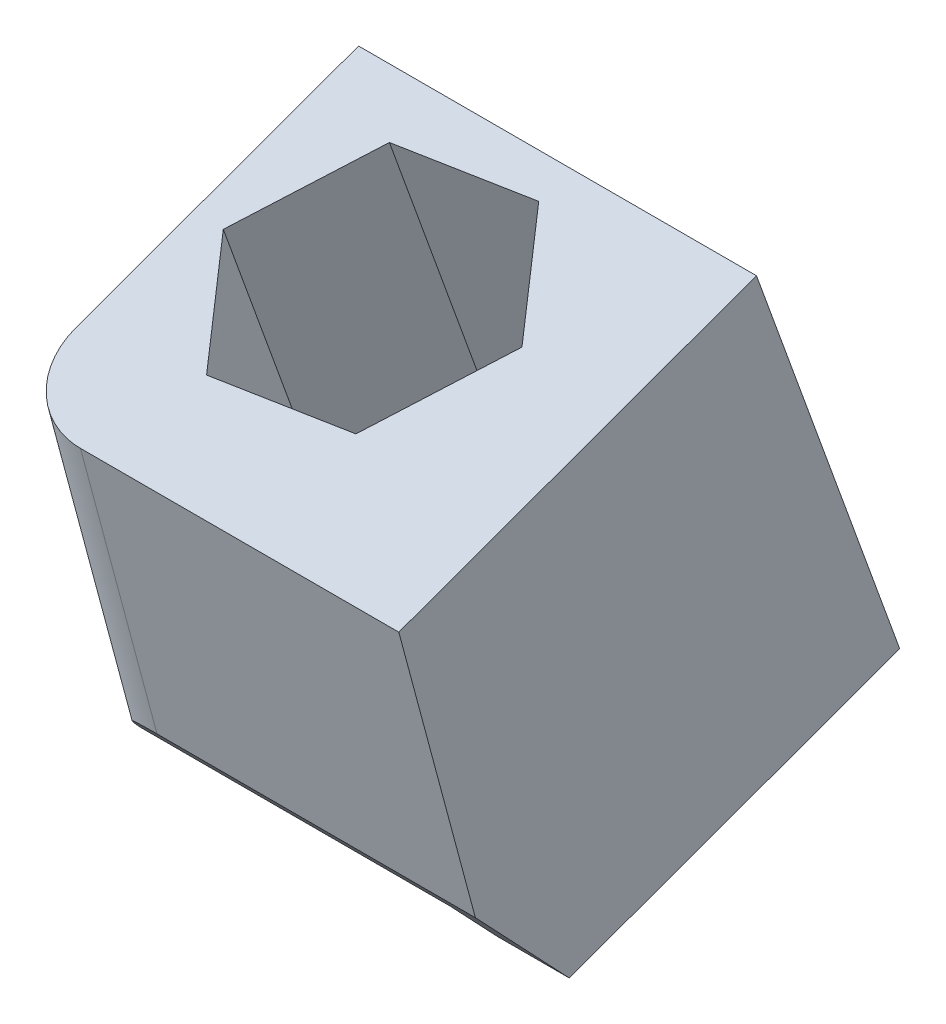
ISO-10303-21;
HEADER;
FILE_DESCRIPTION(('STEP AP214'),'2;1');
FILE_NAME('part.step','',(''),(''),'','','');
FILE_SCHEMA(('AUTOMOTIVE_DESIGN { 1 0 10303 214 1 1 1 1 }'));
ENDSEC;
DATA;
#1=APPLICATION_CONTEXT('core data for automotive mechanical design processes');
#2=APPLICATION_PROTOCOL_DEFINITION('international standard','automotive_design',2000,#1);
#3=PRODUCT_CONTEXT('',#1,'mechanical');
#4=PRODUCT('Part','Part','',(#3));
#5=PRODUCT_RELATED_PRODUCT_CATEGORY('part','',(#4));
#6=PRODUCT_DEFINITION_FORMATION('','',#4);
#7=PRODUCT_DEFINITION_CONTEXT('part definition',#1,'design');
#8=PRODUCT_DEFINITION('design','',#6,#7);
#9=PRODUCT_DEFINITION_SHAPE('','',#8);
#10=(LENGTH_UNIT() NAMED_UNIT(*) SI_UNIT(.MILLI.,.METRE.));
#11=(NAMED_UNIT(*) PLANE_ANGLE_UNIT() SI_UNIT($,.RADIAN.));
#12=(NAMED_UNIT(*) SI_UNIT($,.STERADIAN.) SOLID_ANGLE_UNIT());
#13=UNCERTAINTY_MEASURE_WITH_UNIT(LENGTH_MEASURE(1.E-05),#10,'distance_accuracy_value','');
#14=(GEOMETRIC_REPRESENTATION_CONTEXT(3) GLOBAL_UNCERTAINTY_ASSIGNED_CONTEXT((#13)) GLOBAL_UNIT_ASSIGNED_CONTEXT((#10,
#11,#12)) REPRESENTATION_CONTEXT('',''));
#15=CARTESIAN_POINT('',(0.,0.,0.));
#16=DIRECTION('',(0.,0.,1.));
#17=DIRECTION('',(1.,0.,0.));
#18=AXIS2_PLACEMENT_3D('',#15,#16,#17);
#19=CARTESIAN_POINT('',(0.,0.,0.));
#20=DIRECTION('',(-1.,0.,0.));
#21=DIRECTION('',(0.,0.,-1.));
#22=AXIS2_PLACEMENT_3D('',#19,#20,#21);
#23=PLANE('',#22);
#24=DIRECTION('',(0.,0.341123131095332,-0.940018621853693));
#25=VECTOR('',#24,1.);
#26=CARTESIAN_POINT('',(0.,171.265590649727,97.4199582610171));
#27=LINE('',#26,#25);
#28=CARTESIAN_POINT('',(0.,168.688536046259,104.521438917035));
#29=VERTEX_POINT('',#28);
#30=CARTESIAN_POINT('',(0.,171.265590649727,97.4199582610171));
#31=VERTEX_POINT('',#30);
#32=EDGE_CURVE('E209',#29,#31,#27,.T.);
#33=ORIENTED_EDGE('',*,*,#32,.T.);
#34=DIRECTION('',(0.,-0.940018621853693,-0.341123131095332));
#35=VECTOR('',#34,1.);
#36=CARTESIAN_POINT('',(0.,171.265590649727,97.4199582610171));
#37=LINE('',#36,#35);
#38=CARTESIAN_POINT('',(0.,162.852423984136,94.3669062377139));
#39=VERTEX_POINT('',#38);
#40=EDGE_CURVE('E214',#31,#39,#37,.T.);
#41=ORIENTED_EDGE('',*,*,#40,.T.);
#42=DIRECTION('',(0.,-0.341123131095332,0.940018621853693));
#43=VECTOR('',#42,1.);
#44=CARTESIAN_POINT('',(0.,162.852423984136,94.3669062377139));
#45=LINE('',#44,#43);
#46=CARTESIAN_POINT('',(0.,160.011650268805,102.195106525128));
#47=VERTEX_POINT('',#46);
#48=EDGE_CURVE('E144',#39,#47,#45,.T.);
#49=ORIENTED_EDGE('',*,*,#48,.T.);
#50=DIRECTION('',(0.,0.965887749349842,0.258961108384823));
#51=VECTOR('',#50,1.);
#52=CARTESIAN_POINT('',(0.,161.344698217693,102.552505792907));
#53=LINE('',#52,#51);
#54=EDGE_CURVE('E246',#29,#47,#53,.F.);
#55=ORIENTED_EDGE('',*,*,#54,.F.);
#56=EDGE_LOOP('',(#33,#41,#49,#55));
#57=FACE_BOUND('',#56,.T.);
#58=ADVANCED_FACE('F35',(#57),#23,.T.);
#59=CARTESIAN_POINT('',(5.34740721586496,172.331144249481,98.7343217056999));
#60=DIRECTION('',(-0.138711114408334,0.33782545518257,-0.930931355455539));
#61=DIRECTION('',(0.,-0.940018621853693,-0.341123131095333));
#62=AXIS2_PLACEMENT_3D('',#59,#60,#61);
#63=PLANE('',#62);
#64=DIRECTION('',(0.990332886831291,0.0473175696646939,-0.130391030601912));
#65=VECTOR('',#64,1.);
#66=CARTESIAN_POINT('',(5.34740721586496,162.554950582203,95.1866411423085));
#67=LINE('',#66,#65);
#68=CARTESIAN_POINT('',(2.03114725482848,162.39650147502,95.6232726626925));
#69=VERTEX_POINT('',#68);
#70=CARTESIAN_POINT('',(5.34740721586496,162.554950582203,95.1866411423085));
#71=VERTEX_POINT('',#70);
#72=EDGE_CURVE('E173',#69,#71,#67,.T.);
#73=ORIENTED_EDGE('',*,*,#72,.T.);
#74=DIRECTION('',(0.,-0.940018621853693,-0.341123131095333));
#75=VECTOR('',#74,1.);
#76=CARTESIAN_POINT('',(5.34740721586496,172.331144249481,98.7343217056999));
#77=LINE('',#76,#75);
#78=CARTESIAN_POINT('',(5.34740721586496,170.968117247793,98.2396931656117));
#79=VERTEX_POINT('',#78);
#80=EDGE_CURVE('E179',#79,#71,#77,.T.);
#81=ORIENTED_EDGE('',*,*,#80,.F.);
#82=DIRECTION('',(-0.990332886831291,-0.0473175696646938,0.130391030601912));
#83=VECTOR('',#82,1.);
#84=CARTESIAN_POINT('',(10.0302729632323,171.191862040254,97.6231290798492));
#85=LINE('',#84,#83);
#86=CARTESIAN_POINT('',(2.03114725482848,170.80966814061,98.6763246859957));
#87=VERTEX_POINT('',#86);
#88=EDGE_CURVE('E206',#79,#87,#85,.T.);
#89=ORIENTED_EDGE('',*,*,#88,.T.);
#90=DIRECTION('',(0.,-0.940018621853693,-0.341123131095333));
#91=VECTOR('',#90,1.);
#92=CARTESIAN_POINT('',(2.03114725482848,172.172695142298,99.1709532260839));
#93=LINE('',#92,#91);
#94=EDGE_CURVE('E178',#87,#69,#93,.T.);
#95=ORIENTED_EDGE('',*,*,#94,.T.);
#96=EDGE_LOOP('',(#73,#81,#89,#95));
#97=FACE_BOUND('',#96,.T.);
#98=ADVANCED_FACE('F276',(#97),#63,.F.);
#99=CARTESIAN_POINT('',(7.40779942816731,171.430674983043,101.215706876329));
#100=DIRECTION('',(0.788297880994922,0.209890944966245,-0.578387622654646));
#101=DIRECTION('',(0.591564845887052,0.,0.806257423600322));
#102=AXIS2_PLACEMENT_3D('',#99,#100,#101);
#103=PLANE('',#102);
#104=DIRECTION('',(0.615293792280498,-0.268906641400803,0.741014687703033));
#105=VECTOR('',#104,1.);
#106=CARTESIAN_POINT('',(7.40779942816732,161.654481315765,97.6680263129376));
#107=LINE('',#106,#105);
#108=CARTESIAN_POINT('',(7.40779942816731,161.654481315765,97.6680263129376));
#109=VERTEX_POINT('',#108);
#110=EDGE_CURVE('E170',#71,#109,#107,.T.);
#111=ORIENTED_EDGE('',*,*,#110,.T.);
#112=DIRECTION('',(0.,-0.940018621853693,-0.341123131095333));
#113=VECTOR('',#112,1.);
#114=CARTESIAN_POINT('',(7.40779942816731,171.430674983043,101.215706876329));
#115=LINE('',#114,#113);
#116=CARTESIAN_POINT('',(7.40779942816731,170.067647981355,100.721078336241));
#117=VERTEX_POINT('',#116);
#118=EDGE_CURVE('E183',#117,#109,#115,.T.);
#119=ORIENTED_EDGE('',*,*,#118,.F.);
#120=DIRECTION('',(-0.615293792280498,0.268906641400803,-0.741014687703033));
#121=VECTOR('',#120,1.);
#122=CARTESIAN_POINT('',(6.68584551470969,170.383169126782,99.8516100262584));
#123=LINE('',#122,#121);
#124=EDGE_CURVE('E204',#117,#79,#123,.T.);
#125=ORIENTED_EDGE('',*,*,#124,.T.);
#126=ORIENTED_EDGE('',*,*,#80,.T.);
#127=EDGE_LOOP('',(#111,#119,#125,#126));
#128=FACE_BOUND('',#127,.T.);
#129=ADVANCED_FACE('F280',(#128),#103,.F.);
#130=CARTESIAN_POINT('',(6.15193167943325,170.371756609422,104.133723567342));
#131=DIRECTION('',(0.927008995403243,-0.127934510216321,0.352543732800881));
#132=DIRECTION('',(-0.355464722259819,0.,0.934689697829579));
#133=AXIS2_PLACEMENT_3D('',#130,#131,#132);
#134=PLANE('',#133);
#135=DIRECTION('',(-0.37503909455078,-0.316224211065493,0.871405718304934));
#136=VECTOR('',#135,1.);
#137=CARTESIAN_POINT('',(6.15193167943325,160.595562942144,100.586043003951));
#138=LINE('',#137,#136);
#139=CARTESIAN_POINT('',(6.15193167943325,160.595562942144,100.586043003951));
#140=VERTEX_POINT('',#139);
#141=EDGE_CURVE('E167',#109,#140,#138,.T.);
#142=ORIENTED_EDGE('',*,*,#141,.T.);
#143=DIRECTION('',(0.,-0.940018621853693,-0.341123131095333));
#144=VECTOR('',#143,1.);
#145=CARTESIAN_POINT('',(6.15193167943325,170.371756609422,104.133723567342));
#146=LINE('',#145,#144);
#147=CARTESIAN_POINT('',(6.15193167943325,169.008729607734,103.639095027254));
#148=VERTEX_POINT('',#147);
#149=EDGE_CURVE('E186',#148,#140,#146,.T.);
#150=ORIENTED_EDGE('',*,*,#149,.F.);
#151=DIRECTION('',(0.37503909455078,0.316224211065492,-0.871405718304934));
#152=VECTOR('',#151,1.);
#153=CARTESIAN_POINT('',(8.99331843252483,171.404520599616,97.037114858958));
#154=LINE('',#153,#152);
#155=EDGE_CURVE('E202',#148,#117,#154,.T.);
#156=ORIENTED_EDGE('',*,*,#155,.T.);
#157=ORIENTED_EDGE('',*,*,#118,.T.);
#158=EDGE_LOOP('',(#142,#150,#156,#157));
#159=FACE_BOUND('',#158,.T.);
#160=ADVANCED_FACE('F295',(#159),#134,.F.);
#161=CARTESIAN_POINT('',(2.83567171839683,170.213307502239,104.570355087726));
#162=DIRECTION('',(0.138711114408337,-0.33782545518257,0.930931355455539));
#163=DIRECTION('',(0.,0.940018621853693,0.341123131095333));
#164=AXIS2_PLACEMENT_3D('',#161,#162,#163);
#165=PLANE('',#164);
#166=DIRECTION('',(-0.99033288683129,-0.0473175696646948,0.130391030601915));
#167=VECTOR('',#166,1.);
#168=CARTESIAN_POINT('',(2.83567171839683,160.437113834961,101.022674524335));
#169=LINE('',#168,#167);
#170=CARTESIAN_POINT('',(2.83567171839683,160.437113834961,101.022674524335));
#171=VERTEX_POINT('',#170);
#172=EDGE_CURVE('E164',#140,#171,#169,.T.);
#173=ORIENTED_EDGE('',*,*,#172,.T.);
#174=DIRECTION('',(0.,-0.940018621853693,-0.341123131095333));
#175=VECTOR('',#174,1.);
#176=CARTESIAN_POINT('',(2.83567171839683,170.213307502239,104.570355087726));
#177=LINE('',#176,#175);
#178=CARTESIAN_POINT('',(2.83567171839683,168.850280500551,104.075726547638));
#179=VERTEX_POINT('',#178);
#180=EDGE_CURVE('E189',#179,#171,#177,.T.);
#181=ORIENTED_EDGE('',*,*,#180,.F.);
#182=DIRECTION('',(0.99033288683129,0.0473175696646947,-0.130391030601915));
#183=VECTOR('',#182,1.);
#184=CARTESIAN_POINT('',(10.8347974268006,169.232474400195,103.022530941491));
#185=LINE('',#184,#183);
#186=EDGE_CURVE('E200',#179,#148,#185,.T.);
#187=ORIENTED_EDGE('',*,*,#186,.T.);
#188=ORIENTED_EDGE('',*,*,#149,.T.);
#189=EDGE_LOOP('',(#173,#181,#187,#188));
#190=FACE_BOUND('',#189,.T.);
#191=ADVANCED_FACE('F291',(#190),#165,.F.);
#192=CARTESIAN_POINT('',(0.775279506094418,171.113776768677,102.088969917097));
#193=DIRECTION('',(-0.788297880994913,-0.209890944966249,0.578387622654656));
#194=DIRECTION('',(-0.591564845887063,0.,-0.806257423600314));
#195=AXIS2_PLACEMENT_3D('',#192,#193,#194);
#196=PLANE('',#195);
#197=DIRECTION('',(-0.615293792280509,0.2689066414008,-0.741014687703025));
#198=VECTOR('',#197,1.);
#199=CARTESIAN_POINT('',(0.775279506094421,161.337583101399,98.5412893537055));
#200=LINE('',#199,#198);
#201=CARTESIAN_POINT('',(0.775279506094418,161.337583101399,98.5412893537055));
#202=VERTEX_POINT('',#201);
#203=EDGE_CURVE('E152',#171,#202,#200,.T.);
#204=ORIENTED_EDGE('',*,*,#203,.T.);
#205=DIRECTION('',(0.,-0.940018621853693,-0.341123131095333));
#206=VECTOR('',#205,1.);
#207=CARTESIAN_POINT('',(0.775279506094418,171.113776768677,102.088969917097));
#208=LINE('',#207,#206);
#209=CARTESIAN_POINT('',(0.775279506094418,169.750749766989,101.594341377009));
#210=VERTEX_POINT('',#209);
#211=EDGE_CURVE('E192',#210,#202,#208,.T.);
#212=ORIENTED_EDGE('',*,*,#211,.F.);
#213=DIRECTION('',(0.615293792280509,-0.2689066414008,0.741014687703025));
#214=VECTOR('',#213,1.);
#215=CARTESIAN_POINT('',(2.1137178049392,169.165801645977,103.206258237656));
#216=LINE('',#215,#214);
#217=EDGE_CURVE('E198',#210,#179,#216,.T.);
#218=ORIENTED_EDGE('',*,*,#217,.T.);
#219=ORIENTED_EDGE('',*,*,#180,.T.);
#220=EDGE_LOOP('',(#204,#212,#218,#219));
#221=FACE_BOUND('',#220,.T.);
#222=ADVANCED_FACE('F287',(#221),#196,.F.);
#223=CARTESIAN_POINT('',(2.03114725482848,172.172695142298,99.1709532260839));
#224=DIRECTION('',(-0.927008995403244,0.127934510216321,-0.352543732800881));
#225=DIRECTION('',(0.355464722259818,0.,-0.934689697829579));
#226=AXIS2_PLACEMENT_3D('',#223,#224,#225);
#227=PLANE('',#226);
#228=DIRECTION('',(0.37503909455078,0.316224211065493,-0.871405718304934));
#229=VECTOR('',#228,1.);
#230=CARTESIAN_POINT('',(2.03114725482847,162.39650147502,95.6232726626925));
#231=LINE('',#230,#229);
#232=EDGE_CURVE('E239',#202,#69,#231,.T.);
#233=ORIENTED_EDGE('',*,*,#232,.T.);
#234=ORIENTED_EDGE('',*,*,#94,.F.);
#235=DIRECTION('',(-0.37503909455078,-0.316224211065493,0.871405718304934));
#236=VECTOR('',#235,1.);
#237=CARTESIAN_POINT('',(3.61666625918597,172.146540758871,94.9923612087129));
#238=LINE('',#237,#236);
#239=EDGE_CURVE('E182',#87,#210,#238,.T.);
#240=ORIENTED_EDGE('',*,*,#239,.T.);
#241=ORIENTED_EDGE('',*,*,#211,.T.);
#242=EDGE_LOOP('',(#233,#234,#240,#241));
#243=FACE_BOUND('',#242,.T.);
#244=ADVANCED_FACE('F284',(#243),#227,.F.);
#245=CARTESIAN_POINT('',(10.,171.265590649727,97.4199582610171));
#246=DIRECTION('',(0.,-0.940018621853693,-0.341123131095332));
#247=DIRECTION('',(0.,-0.341123131095332,0.940018621853693));
#248=AXIS2_PLACEMENT_3D('',#245,#246,#247);
#249=PLANE('',#248);
#250=ORIENTED_EDGE('',*,*,#124,.F.);
#251=ORIENTED_EDGE('',*,*,#155,.F.);
#252=ORIENTED_EDGE('',*,*,#186,.F.);
#253=ORIENTED_EDGE('',*,*,#217,.F.);
#254=ORIENTED_EDGE('',*,*,#239,.F.);
#255=ORIENTED_EDGE('',*,*,#88,.F.);
#256=EDGE_LOOP('',(#250,#251,#252,#253,#254,#255));
#257=FACE_BOUND('',#256,.T.);
#258=DIRECTION('',(-1.,0.,0.));
#259=VECTOR('',#258,1.);
#260=CARTESIAN_POINT('',(10.,168.00374929035,106.408476892109));
#261=LINE('',#260,#259);
#262=CARTESIAN_POINT('',(10.,168.00374929035,106.408476892109));
#263=VERTEX_POINT('',#262);
#264=CARTESIAN_POINT('',(2.,168.00374929035,106.408476892109));
#265=VERTEX_POINT('',#264);
#266=EDGE_CURVE('E224',#263,#265,#261,.T.);
#267=ORIENTED_EDGE('',*,*,#266,.F.);
#268=DIRECTION('',(0.,0.341123131095332,-0.940018621853693));
#269=VECTOR('',#268,1.);
#270=CARTESIAN_POINT('',(10.,171.265590649727,97.4199582610171));
#271=LINE('',#270,#269);
#272=CARTESIAN_POINT('',(10.,171.265590649727,97.4199582610171));
#273=VERTEX_POINT('',#272);
#274=EDGE_CURVE('E210',#263,#273,#271,.T.);
#275=ORIENTED_EDGE('',*,*,#274,.T.);
#276=DIRECTION('',(-1.,0.,0.));
#277=VECTOR('',#276,1.);
#278=CARTESIAN_POINT('',(10.,171.265590649727,97.4199582610171));
#279=LINE('',#278,#277);
#280=EDGE_CURVE('E237',#273,#31,#279,.T.);
#281=ORIENTED_EDGE('',*,*,#280,.T.);
#282=ORIENTED_EDGE('',*,*,#32,.F.);
#283=CARTESIAN_POINT('',(2.,168.688536046259,104.521438917035));
#284=DIRECTION('',(0.,0.940018621853693,0.341123131095332));
#285=DIRECTION('',(0.,-0.341123131095332,0.940018621853693));
#286=AXIS2_PLACEMENT_3D('',#283,#284,#285);
#287=ELLIPSE('',#286,2.00744743902357,2.);
#288=EDGE_CURVE('E244',#265,#29,#287,.F.);
#289=ORIENTED_EDGE('',*,*,#288,.F.);
#290=EDGE_LOOP('',(#267,#275,#281,#282,#289));
#291=FACE_BOUND('',#290,.T.);
#292=ADVANCED_FACE('F255',(#257,#291),#249,.F.);
#293=CARTESIAN_POINT('',(10.,171.265590649727,97.4199582610171));
#294=DIRECTION('',(0.,-0.341123131095332,0.940018621853693));
#295=DIRECTION('',(0.,0.940018621853693,0.341123131095332));
#296=AXIS2_PLACEMENT_3D('',#293,#294,#295);
#297=PLANE('',#296);
#298=DIRECTION('',(-1.,0.,0.));
#299=VECTOR('',#298,1.);
#300=CARTESIAN_POINT('',(0.,162.852423984136,94.3669062377139));
#301=LINE('',#300,#299);
#302=CARTESIAN_POINT('',(8.2,162.852423984136,94.3669062377139));
#303=VERTEX_POINT('',#302);
#304=EDGE_CURVE('E143',#303,#39,#301,.T.);
#305=ORIENTED_EDGE('',*,*,#304,.T.);
#306=ORIENTED_EDGE('',*,*,#40,.F.);
#307=ORIENTED_EDGE('',*,*,#280,.F.);
#308=DIRECTION('',(0.,-0.940018621853693,-0.341123131095332));
#309=VECTOR('',#308,1.);
#310=CARTESIAN_POINT('',(10.,171.265590649727,97.4199582610171));
#311=LINE('',#310,#309);
#312=CARTESIAN_POINT('',(10.,161.34839418917,93.8211092279614));
#313=VERTEX_POINT('',#312);
#314=EDGE_CURVE('E213',#273,#313,#311,.T.);
#315=ORIENTED_EDGE('',*,*,#314,.T.);
#316=DIRECTION('',(-1.,0.,0.));
#317=VECTOR('',#316,1.);
#318=CARTESIAN_POINT('',(10.,161.34839418917,93.8211092279614));
#319=LINE('',#318,#317);
#320=CARTESIAN_POINT('',(8.2,161.34839418917,93.8211092279614));
#321=VERTEX_POINT('',#320);
#322=EDGE_CURVE('E151',#313,#321,#319,.T.);
#323=ORIENTED_EDGE('',*,*,#322,.T.);
#324=DIRECTION('',(0.,-0.940018621853693,-0.341123131095332));
#325=VECTOR('',#324,1.);
#326=CARTESIAN_POINT('',(8.2,162.852423984136,94.3669062377139));
#327=LINE('',#326,#325);
#328=EDGE_CURVE('E138',#303,#321,#327,.T.);
#329=ORIENTED_EDGE('',*,*,#328,.F.);
#330=EDGE_LOOP('',(#305,#306,#307,#315,#323,#329));
#331=FACE_BOUND('',#330,.T.);
#332=ADVANCED_FACE('F147',(#331),#297,.F.);
#333=CARTESIAN_POINT('',(10.,158.335097963573,102.124722518938));
#334=DIRECTION('',(0.,0.940018621853693,0.341123131095332));
#335=DIRECTION('',(0.,0.341123131095332,-0.940018621853693));
#336=AXIS2_PLACEMENT_3D('',#333,#334,#335);
#337=PLANE('',#336);
#338=ORIENTED_EDGE('',*,*,#322,.F.);
#339=DIRECTION('',(0.,-0.341123131095332,0.940018621853693));
#340=VECTOR('',#339,1.);
#341=CARTESIAN_POINT('',(10.,158.335097963573,102.124722518938));
#342=LINE('',#341,#340);
#343=CARTESIAN_POINT('',(10.,158.335097963573,102.124722518938));
#344=VERTEX_POINT('',#343);
#345=EDGE_CURVE('E216',#313,#344,#342,.T.);
#346=ORIENTED_EDGE('',*,*,#345,.T.);
#347=DIRECTION('',(-1.,0.,0.));
#348=VECTOR('',#347,1.);
#349=CARTESIAN_POINT('',(10.,158.335097963573,102.124722518938));
#350=LINE('',#349,#348);
#351=CARTESIAN_POINT('',(8.2,158.335097963573,102.124722518938));
#352=VERTEX_POINT('',#351);
#353=EDGE_CURVE('E233',#344,#352,#350,.T.);
#354=ORIENTED_EDGE('',*,*,#353,.T.);
#355=DIRECTION('',(0.,0.341123131095333,-0.940018621853693));
#356=VECTOR('',#355,1.);
#357=CARTESIAN_POINT('',(8.2,161.34839418917,93.8211092279614));
#358=LINE('',#357,#356);
#359=EDGE_CURVE('E160',#352,#321,#358,.T.);
#360=ORIENTED_EDGE('',*,*,#359,.T.);
#361=EDGE_LOOP('',(#338,#346,#354,#360));
#362=FACE_BOUND('',#361,.T.);
#363=ADVANCED_FACE('F261',(#362),#337,.F.);
#364=CARTESIAN_POINT('',(10.,158.335097963573,102.124722518938));
#365=DIRECTION('',(0.,0.687594389221847,-0.726095004741552));
#366=DIRECTION('',(0.,-0.726095004741552,-0.687594389221847));
#367=AXIS2_PLACEMENT_3D('',#364,#365,#366);
#368=PLANE('',#367);
#369=DIRECTION('',(1.,0.,0.));
#370=VECTOR('',#369,1.);
#371=CARTESIAN_POINT('',(10.,159.601868854537,103.324323881525));
#372=LINE('',#371,#370);
#373=CARTESIAN_POINT('',(0.397615942011993,159.601868854537,103.324323881525));
#374=VERTEX_POINT('',#373);
#375=CARTESIAN_POINT('',(8.2,159.601868854537,103.324323881525));
#376=VERTEX_POINT('',#375);
#377=EDGE_CURVE('E176',#374,#376,#372,.T.);
#378=ORIENTED_EDGE('',*,*,#377,.T.);
#379=DIRECTION('',(0.,0.726095004741552,0.687594389221847));
#380=VECTOR('',#379,1.);
#381=CARTESIAN_POINT('',(8.2,158.335097963573,102.124722518938));
#382=LINE('',#381,#380);
#383=EDGE_CURVE('E140',#352,#376,#382,.T.);
#384=ORIENTED_EDGE('',*,*,#383,.F.);
#385=ORIENTED_EDGE('',*,*,#353,.F.);
#386=DIRECTION('',(0.,0.726095004741552,0.687594389221847));
#387=VECTOR('',#386,1.);
#388=CARTESIAN_POINT('',(10.,158.335097963573,102.124722518938));
#389=LINE('',#388,#387);
#390=CARTESIAN_POINT('',(10.,160.826776000923,104.484281291607));
#391=VERTEX_POINT('',#390);
#392=EDGE_CURVE('E219',#344,#391,#389,.T.);
#393=ORIENTED_EDGE('',*,*,#392,.T.);
#394=DIRECTION('',(-1.,0.,0.));
#395=VECTOR('',#394,1.);
#396=CARTESIAN_POINT('',(10.,160.826776000923,104.484281291607));
#397=LINE('',#396,#395);
#398=CARTESIAN_POINT('',(2.,160.826776000923,104.484281291607));
#399=VERTEX_POINT('',#398);
#400=EDGE_CURVE('E230',#391,#399,#397,.T.);
#401=ORIENTED_EDGE('',*,*,#400,.T.);
#402=CARTESIAN_POINT('',(2.,157.776652734014,101.595888407665));
#403=DIRECTION('',(0.,-0.687594389221847,0.726095004741552));
#404=DIRECTION('',(0.,-0.726095004741552,-0.687594389221847));
#405=AXIS2_PLACEMENT_3D('',#402,#403,#404);
#406=ELLIPSE('',#405,4.2007220088154,2.);
#407=EDGE_CURVE('E11',#374,#399,#406,.F.);
#408=ORIENTED_EDGE('',*,*,#407,.F.);
#409=EDGE_LOOP('',(#378,#384,#385,#393,#401,#408));
#410=FACE_BOUND('',#409,.T.);
#411=ADVANCED_FACE('F263',(#410),#368,.F.);
#412=CARTESIAN_POINT('',(10.,168.00374929035,106.408476892109));
#413=DIRECTION('',(0.,0.258961108384823,-0.965887749349843));
#414=DIRECTION('',(0.,-0.965887749349842,-0.258961108384823));
#415=AXIS2_PLACEMENT_3D('',#412,#413,#414);
#416=PLANE('',#415);
#417=ORIENTED_EDGE('',*,*,#400,.F.);
#418=DIRECTION('',(0.,0.965887749349843,0.258961108384823));
#419=VECTOR('',#418,1.);
#420=CARTESIAN_POINT('',(10.,168.00374929035,106.408476892109));
#421=LINE('',#420,#419);
#422=EDGE_CURVE('E222',#391,#263,#421,.T.);
#423=ORIENTED_EDGE('',*,*,#422,.T.);
#424=ORIENTED_EDGE('',*,*,#266,.T.);
#425=DIRECTION('',(0.,0.965887749349842,0.258961108384823));
#426=VECTOR('',#425,1.);
#427=CARTESIAN_POINT('',(2.,168.00374929035,106.408476892109));
#428=LINE('',#427,#426);
#429=EDGE_CURVE('E242',#399,#265,#428,.T.);
#430=ORIENTED_EDGE('',*,*,#429,.F.);
#431=EDGE_LOOP('',(#417,#423,#424,#430));
#432=FACE_BOUND('',#431,.T.);
#433=ADVANCED_FACE('F265',(#432),#416,.F.);
#434=CARTESIAN_POINT('',(10.,0.,0.));
#435=DIRECTION('',(-1.,0.,0.));
#436=DIRECTION('',(0.,0.,-1.));
#437=AXIS2_PLACEMENT_3D('',#434,#435,#436);
#438=PLANE('',#437);
#439=ORIENTED_EDGE('',*,*,#274,.F.);
#440=ORIENTED_EDGE('',*,*,#422,.F.);
#441=ORIENTED_EDGE('',*,*,#392,.F.);
#442=ORIENTED_EDGE('',*,*,#345,.F.);
#443=ORIENTED_EDGE('',*,*,#314,.F.);
#444=EDGE_LOOP('',(#439,#440,#441,#442,#443));
#445=FACE_BOUND('',#444,.T.);
#446=ADVANCED_FACE('F257',(#445),#438,.F.);
#447=CARTESIAN_POINT('',(8.2,162.852423984136,94.3669062377139));
#448=DIRECTION('',(1.,0.,0.));
#449=DIRECTION('',(0.,0.,1.));
#450=AXIS2_PLACEMENT_3D('',#447,#448,#449);
#451=PLANE('',#450);
#452=ORIENTED_EDGE('',*,*,#359,.F.);
#453=ORIENTED_EDGE('',*,*,#383,.T.);
#454=DIRECTION('',(0.,0.34112313109533,-0.940018621853694));
#455=VECTOR('',#454,1.);
#456=CARTESIAN_POINT('',(8.2,159.585298821167,103.369985223463));
#457=LINE('',#456,#455);
#458=EDGE_CURVE('E134',#376,#303,#457,.T.);
#459=ORIENTED_EDGE('',*,*,#458,.T.);
#460=ORIENTED_EDGE('',*,*,#328,.T.);
#461=EDGE_LOOP('',(#452,#453,#459,#460));
#462=FACE_BOUND('',#461,.T.);
#463=ADVANCED_FACE('F137',(#462),#451,.F.);
#464=CARTESIAN_POINT('',(0.,174.161993110282,63.2016036984743));
#465=DIRECTION('',(0.,-0.940018621853693,-0.341123131095332));
#466=DIRECTION('',(0.,-0.341123131095332,0.940018621853693));
#467=AXIS2_PLACEMENT_3D('',#464,#465,#466);
#468=PLANE('',#467);
#469=ORIENTED_EDGE('',*,*,#72,.F.);
#470=ORIENTED_EDGE('',*,*,#232,.F.);
#471=ORIENTED_EDGE('',*,*,#203,.F.);
#472=ORIENTED_EDGE('',*,*,#172,.F.);
#473=ORIENTED_EDGE('',*,*,#141,.F.);
#474=ORIENTED_EDGE('',*,*,#110,.F.);
#475=EDGE_LOOP('',(#469,#470,#471,#472,#473,#474));
#476=FACE_BOUND('',#475,.T.);
#477=ORIENTED_EDGE('',*,*,#48,.F.);
#478=ORIENTED_EDGE('',*,*,#304,.F.);
#479=ORIENTED_EDGE('',*,*,#458,.F.);
#480=ORIENTED_EDGE('',*,*,#377,.F.);
#481=CARTESIAN_POINT('',(2.,160.011650268805,102.195106525128));
#482=DIRECTION('',(0.,0.940018621853693,0.341123131095332));
#483=DIRECTION('',(0.,-0.341123131095332,0.940018621853693));
#484=AXIS2_PLACEMENT_3D('',#481,#482,#483);
#485=ELLIPSE('',#484,2.00744743902357,2.);
#486=EDGE_CURVE('E43',#47,#374,#485,.T.);
#487=ORIENTED_EDGE('',*,*,#486,.F.);
#488=EDGE_LOOP('',(#477,#478,#479,#480,#487));
#489=FACE_BOUND('',#488,.T.);
#490=ADVANCED_FACE('F154',(#476,#489),#468,.T.);
#491=CARTESIAN_POINT('',(2.,168.521671507119,104.476701393409));
#492=DIRECTION('',(0.,-0.965887749349842,-0.258961108384823));
#493=DIRECTION('',(0.,-0.258961108384823,0.965887749349843));
#494=AXIS2_PLACEMENT_3D('',#491,#492,#493);
#495=CYLINDRICAL_SURFACE('',#494,2.);
#496=ORIENTED_EDGE('',*,*,#486,.T.);
#497=ORIENTED_EDGE('',*,*,#407,.T.);
#498=ORIENTED_EDGE('',*,*,#429,.T.);
#499=ORIENTED_EDGE('',*,*,#288,.T.);
#500=ORIENTED_EDGE('',*,*,#54,.T.);
#501=EDGE_LOOP('',(#496,#497,#498,#499,#500));
#502=FACE_BOUND('',#501,.T.);
#503=ADVANCED_FACE('F37',(#502),#495,.T.);
#504=CLOSED_SHELL('',(#58,#98,#129,#160,#191,#222,#244,#292,#332,#363,#411,#433,#446,#463,#490,#503));
#505=MANIFOLD_SOLID_BREP('B2',#504);
#506=ADVANCED_BREP_SHAPE_REPRESENTATION('',(#18,#505),#14);
#507=SHAPE_DEFINITION_REPRESENTATION(#9,#506);
ENDSEC;
END-ISO-10303-21;
